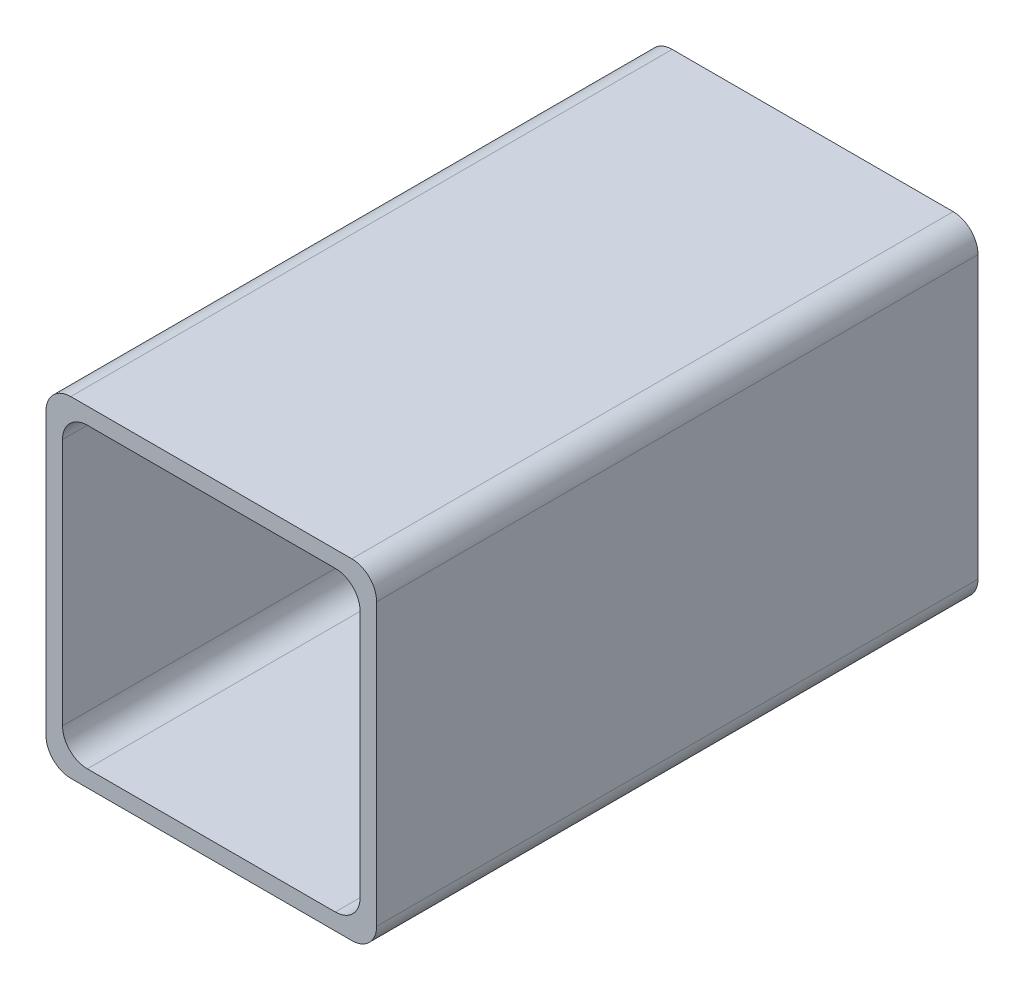
ISO-10303-21;
HEADER;
FILE_DESCRIPTION(('STEP AP214'),'2;1');
FILE_NAME('part.step','',(''),(''),'','','');
FILE_SCHEMA(('AUTOMOTIVE_DESIGN { 1 0 10303 214 1 1 1 1 }'));
ENDSEC;
DATA;
#1=APPLICATION_CONTEXT('core data for automotive mechanical design processes');
#2=APPLICATION_PROTOCOL_DEFINITION('international standard','automotive_design',2000,#1);
#3=PRODUCT_CONTEXT('',#1,'mechanical');
#4=PRODUCT('Part','Part','',(#3));
#5=PRODUCT_RELATED_PRODUCT_CATEGORY('part','',(#4));
#6=PRODUCT_DEFINITION_FORMATION('','',#4);
#7=PRODUCT_DEFINITION_CONTEXT('part definition',#1,'design');
#8=PRODUCT_DEFINITION('design','',#6,#7);
#9=PRODUCT_DEFINITION_SHAPE('','',#8);
#10=(LENGTH_UNIT() NAMED_UNIT(*) SI_UNIT(.MILLI.,.METRE.));
#11=(NAMED_UNIT(*) PLANE_ANGLE_UNIT() SI_UNIT($,.RADIAN.));
#12=(NAMED_UNIT(*) SI_UNIT($,.STERADIAN.) SOLID_ANGLE_UNIT());
#13=UNCERTAINTY_MEASURE_WITH_UNIT(LENGTH_MEASURE(1.E-05),#10,'distance_accuracy_value','');
#14=(GEOMETRIC_REPRESENTATION_CONTEXT(3) GLOBAL_UNCERTAINTY_ASSIGNED_CONTEXT((#13)) GLOBAL_UNIT_ASSIGNED_CONTEXT((#10,
#11,#12)) REPRESENTATION_CONTEXT('',''));
#15=CARTESIAN_POINT('',(0.,0.,0.));
#16=DIRECTION('',(0.,0.,1.));
#17=DIRECTION('',(1.,0.,0.));
#18=AXIS2_PLACEMENT_3D('',#15,#16,#17);
#19=CARTESIAN_POINT('',(-20.0000000000002,17.0000000000001,129.318542494924));
#20=DIRECTION('',(1.,0.,0.));
#21=DIRECTION('',(0.,0.,-1.));
#22=AXIS2_PLACEMENT_3D('',#19,#20,#21);
#23=PLANE('',#22);
#24=DIRECTION('',(0.,-1.,0.));
#25=VECTOR('',#24,1.);
#26=CARTESIAN_POINT('',(-19.9999999999999,17.,72.7499999999999));
#27=LINE('',#26,#25);
#28=CARTESIAN_POINT('',(-19.9999999999999,17.,72.7499999999999));
#29=VERTEX_POINT('',#28);
#30=CARTESIAN_POINT('',(-19.9999999999997,-17.,72.7499999999999));
#31=VERTEX_POINT('',#30);
#32=EDGE_CURVE('E303',#29,#31,#27,.T.);
#33=ORIENTED_EDGE('',*,*,#32,.F.);
#34=DIRECTION('',(0.,0.,-1.));
#35=VECTOR('',#34,1.);
#36=CARTESIAN_POINT('',(-20.0000000000002,17.0000000000001,129.318542494924));
#37=LINE('',#36,#35);
#38=CARTESIAN_POINT('',(-20.0000000000002,17.,0.));
#39=VERTEX_POINT('',#38);
#40=EDGE_CURVE('E47',#29,#39,#37,.T.);
#41=ORIENTED_EDGE('',*,*,#40,.T.);
#42=DIRECTION('',(0.,-1.,0.));
#43=VECTOR('',#42,1.);
#44=CARTESIAN_POINT('',(-20.0000000000002,17.,0.));
#45=LINE('',#44,#43);
#46=CARTESIAN_POINT('',(-20.,-17.,0.));
#47=VERTEX_POINT('',#46);
#48=EDGE_CURVE('E198',#39,#47,#45,.T.);
#49=ORIENTED_EDGE('',*,*,#48,.T.);
#50=DIRECTION('',(0.,0.,-1.));
#51=VECTOR('',#50,1.);
#52=CARTESIAN_POINT('',(-20.,-16.9999999999999,129.318542494924));
#53=LINE('',#52,#51);
#54=EDGE_CURVE('E201',#31,#47,#53,.T.);
#55=ORIENTED_EDGE('',*,*,#54,.F.);
#56=EDGE_LOOP('',(#33,#41,#49,#55));
#57=FACE_BOUND('',#56,.T.);
#58=ADVANCED_FACE('F32',(#57),#23,.F.);
#59=CARTESIAN_POINT('',(-17.0000000000002,17.0000000000001,129.318542494924));
#60=DIRECTION('',(0.,0.,-1.));
#61=DIRECTION('',(-1.,0.,0.));
#62=AXIS2_PLACEMENT_3D('',#59,#60,#61);
#63=CYLINDRICAL_SURFACE('',#62,3.);
#64=CARTESIAN_POINT('',(-16.9999999999999,17.,72.7499999999999));
#65=DIRECTION('',(0.,0.,1.));
#66=DIRECTION('',(1.,0.,0.));
#67=AXIS2_PLACEMENT_3D('',#64,#65,#66);
#68=CIRCLE('',#67,3.);
#69=CARTESIAN_POINT('',(-16.9999999999999,20.,72.7499999999999));
#70=VERTEX_POINT('',#69);
#71=EDGE_CURVE('E239',#70,#29,#68,.T.);
#72=ORIENTED_EDGE('',*,*,#71,.F.);
#73=DIRECTION('',(0.,0.,-1.));
#74=VECTOR('',#73,1.);
#75=CARTESIAN_POINT('',(-17.0000000000002,20.0000000000001,129.318542494924));
#76=LINE('',#75,#74);
#77=CARTESIAN_POINT('',(-17.0000000000002,20.,0.));
#78=VERTEX_POINT('',#77);
#79=EDGE_CURVE('E204',#70,#78,#76,.T.);
#80=ORIENTED_EDGE('',*,*,#79,.T.);
#81=CARTESIAN_POINT('',(-17.0000000000002,17.,0.));
#82=DIRECTION('',(0.,0.,1.));
#83=DIRECTION('',(1.,0.,0.));
#84=AXIS2_PLACEMENT_3D('',#81,#82,#83);
#85=CIRCLE('',#84,3.);
#86=EDGE_CURVE('E196',#78,#39,#85,.T.);
#87=ORIENTED_EDGE('',*,*,#86,.T.);
#88=ORIENTED_EDGE('',*,*,#40,.F.);
#89=EDGE_LOOP('',(#72,#80,#87,#88));
#90=FACE_BOUND('',#89,.T.);
#91=ADVANCED_FACE('F236',(#90),#63,.T.);
#92=CARTESIAN_POINT('',(16.9999999999998,20.0000000000001,129.318542494924));
#93=DIRECTION('',(0.,-1.,0.));
#94=DIRECTION('',(0.,0.,-1.));
#95=AXIS2_PLACEMENT_3D('',#92,#93,#94);
#96=PLANE('',#95);
#97=DIRECTION('',(-1.,0.,0.));
#98=VECTOR('',#97,1.);
#99=CARTESIAN_POINT('',(17.0000000000001,20.,72.7499999999999));
#100=LINE('',#99,#98);
#101=CARTESIAN_POINT('',(17.0000000000001,20.,72.7499999999999));
#102=VERTEX_POINT('',#101);
#103=EDGE_CURVE('E244',#102,#70,#100,.T.);
#104=ORIENTED_EDGE('',*,*,#103,.F.);
#105=DIRECTION('',(0.,0.,-1.));
#106=VECTOR('',#105,1.);
#107=CARTESIAN_POINT('',(16.9999999999998,20.0000000000001,129.318542494924));
#108=LINE('',#107,#106);
#109=CARTESIAN_POINT('',(16.9999999999998,20.,0.));
#110=VERTEX_POINT('',#109);
#111=EDGE_CURVE('E206',#102,#110,#108,.T.);
#112=ORIENTED_EDGE('',*,*,#111,.T.);
#113=DIRECTION('',(-1.,0.,0.));
#114=VECTOR('',#113,1.);
#115=CARTESIAN_POINT('',(16.9999999999998,20.,0.));
#116=LINE('',#115,#114);
#117=EDGE_CURVE('E193',#110,#78,#116,.T.);
#118=ORIENTED_EDGE('',*,*,#117,.T.);
#119=ORIENTED_EDGE('',*,*,#79,.F.);
#120=EDGE_LOOP('',(#104,#112,#118,#119));
#121=FACE_BOUND('',#120,.T.);
#122=ADVANCED_FACE('F242',(#121),#96,.F.);
#123=CARTESIAN_POINT('',(16.9999999999998,17.0000000000001,129.318542494924));
#124=DIRECTION('',(0.,0.,-1.));
#125=DIRECTION('',(-1.,0.,0.));
#126=AXIS2_PLACEMENT_3D('',#123,#124,#125);
#127=CYLINDRICAL_SURFACE('',#126,3.);
#128=CARTESIAN_POINT('',(17.0000000000001,17.,72.7499999999999));
#129=DIRECTION('',(0.,0.,1.));
#130=DIRECTION('',(1.,0.,0.));
#131=AXIS2_PLACEMENT_3D('',#128,#129,#130);
#132=CIRCLE('',#131,3.);
#133=CARTESIAN_POINT('',(20.0000000000001,17.,72.7499999999998));
#134=VERTEX_POINT('',#133);
#135=EDGE_CURVE('E307',#134,#102,#132,.T.);
#136=ORIENTED_EDGE('',*,*,#135,.F.);
#137=DIRECTION('',(0.,0.,-1.));
#138=VECTOR('',#137,1.);
#139=CARTESIAN_POINT('',(19.9999999999999,17.0000000000001,129.318542494924));
#140=LINE('',#139,#138);
#141=CARTESIAN_POINT('',(19.9999999999999,17.,0.));
#142=VERTEX_POINT('',#141);
#143=EDGE_CURVE('E208',#134,#142,#140,.T.);
#144=ORIENTED_EDGE('',*,*,#143,.T.);
#145=CARTESIAN_POINT('',(16.9999999999998,17.,0.));
#146=DIRECTION('',(0.,0.,1.));
#147=DIRECTION('',(-1.,0.,0.));
#148=AXIS2_PLACEMENT_3D('',#145,#146,#147);
#149=CIRCLE('',#148,3.);
#150=EDGE_CURVE('E190',#142,#110,#149,.T.);
#151=ORIENTED_EDGE('',*,*,#150,.T.);
#152=ORIENTED_EDGE('',*,*,#111,.F.);
#153=EDGE_LOOP('',(#136,#144,#151,#152));
#154=FACE_BOUND('',#153,.T.);
#155=ADVANCED_FACE('F247',(#154),#127,.T.);
#156=CARTESIAN_POINT('',(19.9999999999999,17.0000000000001,129.318542494924));
#157=DIRECTION('',(-1.,0.,0.));
#158=DIRECTION('',(0.,0.,1.));
#159=AXIS2_PLACEMENT_3D('',#156,#157,#158);
#160=PLANE('',#159);
#161=DIRECTION('',(0.,1.,0.));
#162=VECTOR('',#161,1.);
#163=CARTESIAN_POINT('',(20.0000000000001,17.,72.7499999999998));
#164=LINE('',#163,#162);
#165=CARTESIAN_POINT('',(20.0000000000003,-17.,72.7499999999999));
#166=VERTEX_POINT('',#165);
#167=EDGE_CURVE('E253',#166,#134,#164,.T.);
#168=ORIENTED_EDGE('',*,*,#167,.F.);
#169=DIRECTION('',(0.,0.,-1.));
#170=VECTOR('',#169,1.);
#171=CARTESIAN_POINT('',(20.,-17.,129.318542494924));
#172=LINE('',#171,#170);
#173=CARTESIAN_POINT('',(20.,-17.,0.));
#174=VERTEX_POINT('',#173);
#175=EDGE_CURVE('E210',#166,#174,#172,.T.);
#176=ORIENTED_EDGE('',*,*,#175,.T.);
#177=DIRECTION('',(0.,1.,0.));
#178=VECTOR('',#177,1.);
#179=CARTESIAN_POINT('',(19.9999999999999,17.,0.));
#180=LINE('',#179,#178);
#181=EDGE_CURVE('E187',#174,#142,#180,.T.);
#182=ORIENTED_EDGE('',*,*,#181,.T.);
#183=ORIENTED_EDGE('',*,*,#143,.F.);
#184=EDGE_LOOP('',(#168,#176,#182,#183));
#185=FACE_BOUND('',#184,.T.);
#186=ADVANCED_FACE('F250',(#185),#160,.F.);
#187=CARTESIAN_POINT('',(17.,-17.,129.318542494924));
#188=DIRECTION('',(0.,0.,-1.));
#189=DIRECTION('',(-1.,0.,0.));
#190=AXIS2_PLACEMENT_3D('',#187,#188,#189);
#191=CYLINDRICAL_SURFACE('',#190,3.);
#192=CARTESIAN_POINT('',(17.0000000000003,-17.,72.75));
#193=DIRECTION('',(0.,0.,1.));
#194=DIRECTION('',(1.,0.,0.));
#195=AXIS2_PLACEMENT_3D('',#192,#193,#194);
#196=CIRCLE('',#195,3.);
#197=CARTESIAN_POINT('',(17.0000000000003,-20.,72.75));
#198=VERTEX_POINT('',#197);
#199=EDGE_CURVE('E257',#198,#166,#196,.T.);
#200=ORIENTED_EDGE('',*,*,#199,.F.);
#201=DIRECTION('',(0.,0.,-1.));
#202=VECTOR('',#201,1.);
#203=CARTESIAN_POINT('',(17.,-20.,129.318542494924));
#204=LINE('',#203,#202);
#205=CARTESIAN_POINT('',(17.,-20.,0.));
#206=VERTEX_POINT('',#205);
#207=EDGE_CURVE('E212',#198,#206,#204,.T.);
#208=ORIENTED_EDGE('',*,*,#207,.T.);
#209=CARTESIAN_POINT('',(17.,-17.,0.));
#210=DIRECTION('',(0.,0.,1.));
#211=DIRECTION('',(1.,0.,0.));
#212=AXIS2_PLACEMENT_3D('',#209,#210,#211);
#213=CIRCLE('',#212,3.);
#214=EDGE_CURVE('E184',#206,#174,#213,.T.);
#215=ORIENTED_EDGE('',*,*,#214,.T.);
#216=ORIENTED_EDGE('',*,*,#175,.F.);
#217=EDGE_LOOP('',(#200,#208,#215,#216));
#218=FACE_BOUND('',#217,.T.);
#219=ADVANCED_FACE('F256',(#218),#191,.T.);
#220=CARTESIAN_POINT('',(17.,-20.,129.318542494924));
#221=DIRECTION('',(0.,1.,0.));
#222=DIRECTION('',(0.,0.,1.));
#223=AXIS2_PLACEMENT_3D('',#220,#221,#222);
#224=PLANE('',#223);
#225=DIRECTION('',(1.,0.,0.));
#226=VECTOR('',#225,1.);
#227=CARTESIAN_POINT('',(17.0000000000003,-20.,72.75));
#228=LINE('',#227,#226);
#229=CARTESIAN_POINT('',(-16.9999999999997,-20.,72.7499999999999));
#230=VERTEX_POINT('',#229);
#231=EDGE_CURVE('E220',#230,#198,#228,.T.);
#232=ORIENTED_EDGE('',*,*,#231,.F.);
#233=DIRECTION('',(0.,0.,-1.));
#234=VECTOR('',#233,1.);
#235=CARTESIAN_POINT('',(-17.,-19.9999999999999,129.318542494924));
#236=LINE('',#235,#234);
#237=CARTESIAN_POINT('',(-17.,-20.,0.));
#238=VERTEX_POINT('',#237);
#239=EDGE_CURVE('E40',#230,#238,#236,.T.);
#240=ORIENTED_EDGE('',*,*,#239,.T.);
#241=DIRECTION('',(1.,0.,0.));
#242=VECTOR('',#241,1.);
#243=CARTESIAN_POINT('',(17.,-20.,0.));
#244=LINE('',#243,#242);
#245=EDGE_CURVE('E181',#238,#206,#244,.T.);
#246=ORIENTED_EDGE('',*,*,#245,.T.);
#247=ORIENTED_EDGE('',*,*,#207,.F.);
#248=EDGE_LOOP('',(#232,#240,#246,#247));
#249=FACE_BOUND('',#248,.T.);
#250=ADVANCED_FACE('F216',(#249),#224,.F.);
#251=CARTESIAN_POINT('',(-17.,-16.9999999999999,129.318542494924));
#252=DIRECTION('',(0.,0.,-1.));
#253=DIRECTION('',(-1.,0.,0.));
#254=AXIS2_PLACEMENT_3D('',#251,#252,#253);
#255=CYLINDRICAL_SURFACE('',#254,3.);
#256=CARTESIAN_POINT('',(-16.9999999999997,-17.,72.7499999999999));
#257=DIRECTION('',(0.,0.,1.));
#258=DIRECTION('',(1.,0.,0.));
#259=AXIS2_PLACEMENT_3D('',#256,#257,#258);
#260=CIRCLE('',#259,3.);
#261=EDGE_CURVE('E230',#31,#230,#260,.T.);
#262=ORIENTED_EDGE('',*,*,#261,.F.);
#263=ORIENTED_EDGE('',*,*,#54,.T.);
#264=CARTESIAN_POINT('',(-17.,-17.,0.));
#265=DIRECTION('',(0.,0.,1.));
#266=DIRECTION('',(-1.,0.,0.));
#267=AXIS2_PLACEMENT_3D('',#264,#265,#266);
#268=CIRCLE('',#267,3.);
#269=EDGE_CURVE('E178',#47,#238,#268,.T.);
#270=ORIENTED_EDGE('',*,*,#269,.T.);
#271=ORIENTED_EDGE('',*,*,#239,.F.);
#272=EDGE_LOOP('',(#262,#263,#270,#271));
#273=FACE_BOUND('',#272,.T.);
#274=ADVANCED_FACE('F34',(#273),#255,.T.);
#275=CARTESIAN_POINT('',(-17.,-17.,0.));
#276=DIRECTION('',(0.,0.,-1.));
#277=DIRECTION('',(-1.,0.,0.));
#278=AXIS2_PLACEMENT_3D('',#275,#276,#277);
#279=PLANE('',#278);
#280=ORIENTED_EDGE('',*,*,#269,.F.);
#281=ORIENTED_EDGE('',*,*,#48,.F.);
#282=ORIENTED_EDGE('',*,*,#86,.F.);
#283=ORIENTED_EDGE('',*,*,#117,.F.);
#284=ORIENTED_EDGE('',*,*,#150,.F.);
#285=ORIENTED_EDGE('',*,*,#181,.F.);
#286=ORIENTED_EDGE('',*,*,#214,.F.);
#287=ORIENTED_EDGE('',*,*,#245,.F.);
#288=EDGE_LOOP('',(#280,#281,#282,#283,#284,#285,#286,#287));
#289=FACE_BOUND('',#288,.T.);
#290=DIRECTION('',(-1.,0.,0.));
#291=VECTOR('',#290,1.);
#292=CARTESIAN_POINT('',(-15.0000000000002,18.,0.));
#293=LINE('',#292,#291);
#294=CARTESIAN_POINT('',(14.9999999999998,18.,0.));
#295=VERTEX_POINT('',#294);
#296=CARTESIAN_POINT('',(-15.0000000000002,18.,0.));
#297=VERTEX_POINT('',#296);
#298=EDGE_CURVE('E160',#295,#297,#293,.T.);
#299=ORIENTED_EDGE('',*,*,#298,.T.);
#300=CARTESIAN_POINT('',(-15.,15.,0.));
#301=DIRECTION('',(0.,0.,1.));
#302=DIRECTION('',(-1.,0.,0.));
#303=AXIS2_PLACEMENT_3D('',#300,#301,#302);
#304=CIRCLE('',#303,3.);
#305=CARTESIAN_POINT('',(-18.,15.,0.));
#306=VERTEX_POINT('',#305);
#307=EDGE_CURVE('E259',#297,#306,#304,.T.);
#308=ORIENTED_EDGE('',*,*,#307,.T.);
#309=DIRECTION('',(0.,-1.,0.));
#310=VECTOR('',#309,1.);
#311=CARTESIAN_POINT('',(-18.,-15.,0.));
#312=LINE('',#311,#310);
#313=CARTESIAN_POINT('',(-18.,-15.,0.));
#314=VERTEX_POINT('',#313);
#315=EDGE_CURVE('E266',#306,#314,#312,.T.);
#316=ORIENTED_EDGE('',*,*,#315,.T.);
#317=CARTESIAN_POINT('',(-15.,-15.,0.));
#318=DIRECTION('',(0.,0.,1.));
#319=DIRECTION('',(1.,0.,0.));
#320=AXIS2_PLACEMENT_3D('',#317,#318,#319);
#321=CIRCLE('',#320,3.);
#322=CARTESIAN_POINT('',(-15.,-18.,0.));
#323=VERTEX_POINT('',#322);
#324=EDGE_CURVE('E269',#314,#323,#321,.T.);
#325=ORIENTED_EDGE('',*,*,#324,.T.);
#326=DIRECTION('',(1.,0.,0.));
#327=VECTOR('',#326,1.);
#328=CARTESIAN_POINT('',(-15.,-18.,0.));
#329=LINE('',#328,#327);
#330=CARTESIAN_POINT('',(15.,-18.,0.));
#331=VERTEX_POINT('',#330);
#332=EDGE_CURVE('E272',#323,#331,#329,.T.);
#333=ORIENTED_EDGE('',*,*,#332,.T.);
#334=CARTESIAN_POINT('',(15.,-15.,0.));
#335=DIRECTION('',(0.,0.,1.));
#336=DIRECTION('',(-1.,0.,0.));
#337=AXIS2_PLACEMENT_3D('',#334,#335,#336);
#338=CIRCLE('',#337,3.);
#339=CARTESIAN_POINT('',(18.,-15.,0.));
#340=VERTEX_POINT('',#339);
#341=EDGE_CURVE('E275',#331,#340,#338,.T.);
#342=ORIENTED_EDGE('',*,*,#341,.T.);
#343=DIRECTION('',(0.,1.,0.));
#344=VECTOR('',#343,1.);
#345=CARTESIAN_POINT('',(18.,-15.,0.));
#346=LINE('',#345,#344);
#347=CARTESIAN_POINT('',(18.,15.,0.));
#348=VERTEX_POINT('',#347);
#349=EDGE_CURVE('E278',#340,#348,#346,.T.);
#350=ORIENTED_EDGE('',*,*,#349,.T.);
#351=CARTESIAN_POINT('',(15.,15.,0.));
#352=DIRECTION('',(0.,0.,1.));
#353=DIRECTION('',(1.,0.,0.));
#354=AXIS2_PLACEMENT_3D('',#351,#352,#353);
#355=CIRCLE('',#354,3.);
#356=EDGE_CURVE('E281',#348,#295,#355,.T.);
#357=ORIENTED_EDGE('',*,*,#356,.T.);
#358=EDGE_LOOP('',(#299,#308,#316,#325,#333,#342,#350,#357));
#359=FACE_BOUND('',#358,.T.);
#360=ADVANCED_FACE('F226',(#289,#359),#279,.T.);
#361=CARTESIAN_POINT('',(-15.0000000000002,18.0000000000001,129.318542494924));
#362=DIRECTION('',(0.,-1.,0.));
#363=DIRECTION('',(0.,0.,-1.));
#364=AXIS2_PLACEMENT_3D('',#361,#362,#363);
#365=PLANE('',#364);
#366=DIRECTION('',(0.,0.,-1.));
#367=VECTOR('',#366,1.);
#368=CARTESIAN_POINT('',(14.9999999999998,18.0000000000001,129.318542494924));
#369=LINE('',#368,#367);
#370=CARTESIAN_POINT('',(15.0000000000001,18.,72.7499999999999));
#371=VERTEX_POINT('',#370);
#372=EDGE_CURVE('E152',#371,#295,#369,.T.);
#373=ORIENTED_EDGE('',*,*,#372,.F.);
#374=DIRECTION('',(-1.,0.,0.));
#375=VECTOR('',#374,1.);
#376=CARTESIAN_POINT('',(-14.9999999999999,18.,72.7499999999999));
#377=LINE('',#376,#375);
#378=CARTESIAN_POINT('',(-14.9999999999999,18.,72.7499999999999));
#379=VERTEX_POINT('',#378);
#380=EDGE_CURVE('E11',#371,#379,#377,.T.);
#381=ORIENTED_EDGE('',*,*,#380,.T.);
#382=DIRECTION('',(0.,0.,-1.));
#383=VECTOR('',#382,1.);
#384=CARTESIAN_POINT('',(-15.0000000000002,18.0000000000001,129.318542494924));
#385=LINE('',#384,#383);
#386=EDGE_CURVE('E162',#379,#297,#385,.T.);
#387=ORIENTED_EDGE('',*,*,#386,.T.);
#388=ORIENTED_EDGE('',*,*,#298,.F.);
#389=EDGE_LOOP('',(#373,#381,#387,#388));
#390=FACE_BOUND('',#389,.T.);
#391=ADVANCED_FACE('F158',(#390),#365,.T.);
#392=CARTESIAN_POINT('',(15.,15.0000000000001,129.318542494924));
#393=DIRECTION('',(0.,0.,-1.));
#394=DIRECTION('',(-1.,0.,0.));
#395=AXIS2_PLACEMENT_3D('',#392,#393,#394);
#396=CYLINDRICAL_SURFACE('',#395,3.);
#397=DIRECTION('',(0.,0.,-1.));
#398=VECTOR('',#397,1.);
#399=CARTESIAN_POINT('',(18.,15.0000000000001,129.318542494924));
#400=LINE('',#399,#398);
#401=CARTESIAN_POINT('',(18.0000000000003,15.0000000000001,72.7499999999999));
#402=VERTEX_POINT('',#401);
#403=EDGE_CURVE('E154',#402,#348,#400,.T.);
#404=ORIENTED_EDGE('',*,*,#403,.F.);
#405=CARTESIAN_POINT('',(15.0000000000003,15.0000000000001,72.7499999999999));
#406=DIRECTION('',(0.,0.,1.));
#407=DIRECTION('',(1.,0.,0.));
#408=AXIS2_PLACEMENT_3D('',#405,#406,#407);
#409=CIRCLE('',#408,3.);
#410=EDGE_CURVE('E145',#402,#371,#409,.T.);
#411=ORIENTED_EDGE('',*,*,#410,.T.);
#412=ORIENTED_EDGE('',*,*,#372,.T.);
#413=ORIENTED_EDGE('',*,*,#356,.F.);
#414=EDGE_LOOP('',(#404,#411,#412,#413));
#415=FACE_BOUND('',#414,.T.);
#416=ADVANCED_FACE('F150',(#415),#396,.F.);
#417=CARTESIAN_POINT('',(18.,-15.,129.318542494924));
#418=DIRECTION('',(-1.,0.,0.));
#419=DIRECTION('',(0.,0.,1.));
#420=AXIS2_PLACEMENT_3D('',#417,#418,#419);
#421=PLANE('',#420);
#422=DIRECTION('',(0.,0.,-1.));
#423=VECTOR('',#422,1.);
#424=CARTESIAN_POINT('',(18.,-15.,129.318542494924));
#425=LINE('',#424,#423);
#426=CARTESIAN_POINT('',(18.0000000000003,-15.,72.75));
#427=VERTEX_POINT('',#426);
#428=EDGE_CURVE('E164',#427,#340,#425,.T.);
#429=ORIENTED_EDGE('',*,*,#428,.F.);
#430=DIRECTION('',(0.,1.,0.));
#431=VECTOR('',#430,1.);
#432=CARTESIAN_POINT('',(18.0000000000003,-15.,72.75));
#433=LINE('',#432,#431);
#434=EDGE_CURVE('E156',#427,#402,#433,.T.);
#435=ORIENTED_EDGE('',*,*,#434,.T.);
#436=ORIENTED_EDGE('',*,*,#403,.T.);
#437=ORIENTED_EDGE('',*,*,#349,.F.);
#438=EDGE_LOOP('',(#429,#435,#436,#437));
#439=FACE_BOUND('',#438,.T.);
#440=ADVANCED_FACE('F287',(#439),#421,.T.);
#441=CARTESIAN_POINT('',(15.,-15.,129.318542494924));
#442=DIRECTION('',(0.,0.,-1.));
#443=DIRECTION('',(-1.,0.,0.));
#444=AXIS2_PLACEMENT_3D('',#441,#442,#443);
#445=CYLINDRICAL_SURFACE('',#444,3.);
#446=DIRECTION('',(0.,0.,-1.));
#447=VECTOR('',#446,1.);
#448=CARTESIAN_POINT('',(15.,-18.,129.318542494924));
#449=LINE('',#448,#447);
#450=CARTESIAN_POINT('',(15.0000000000003,-18.,72.7499999999999));
#451=VERTEX_POINT('',#450);
#452=EDGE_CURVE('E170',#451,#331,#449,.T.);
#453=ORIENTED_EDGE('',*,*,#452,.F.);
#454=CARTESIAN_POINT('',(15.0000000000003,-15.,72.7499999999999));
#455=DIRECTION('',(0.,0.,1.));
#456=DIRECTION('',(1.,0.,0.));
#457=AXIS2_PLACEMENT_3D('',#454,#455,#456);
#458=CIRCLE('',#457,3.);
#459=EDGE_CURVE('E289',#451,#427,#458,.T.);
#460=ORIENTED_EDGE('',*,*,#459,.T.);
#461=ORIENTED_EDGE('',*,*,#428,.T.);
#462=ORIENTED_EDGE('',*,*,#341,.F.);
#463=EDGE_LOOP('',(#453,#460,#461,#462));
#464=FACE_BOUND('',#463,.T.);
#465=ADVANCED_FACE('F324',(#464),#445,.F.);
#466=CARTESIAN_POINT('',(-15.,-18.,129.318542494924));
#467=DIRECTION('',(0.,1.,0.));
#468=DIRECTION('',(0.,0.,1.));
#469=AXIS2_PLACEMENT_3D('',#466,#467,#468);
#470=PLANE('',#469);
#471=DIRECTION('',(0.,0.,-1.));
#472=VECTOR('',#471,1.);
#473=CARTESIAN_POINT('',(-15.,-18.,129.318542494924));
#474=LINE('',#473,#472);
#475=CARTESIAN_POINT('',(-14.9999999999997,-18.,72.75));
#476=VERTEX_POINT('',#475);
#477=EDGE_CURVE('E172',#476,#323,#474,.T.);
#478=ORIENTED_EDGE('',*,*,#477,.F.);
#479=DIRECTION('',(1.,0.,0.));
#480=VECTOR('',#479,1.);
#481=CARTESIAN_POINT('',(-14.9999999999997,-18.,72.75));
#482=LINE('',#481,#480);
#483=EDGE_CURVE('E291',#476,#451,#482,.T.);
#484=ORIENTED_EDGE('',*,*,#483,.T.);
#485=ORIENTED_EDGE('',*,*,#452,.T.);
#486=ORIENTED_EDGE('',*,*,#332,.F.);
#487=EDGE_LOOP('',(#478,#484,#485,#486));
#488=FACE_BOUND('',#487,.T.);
#489=ADVANCED_FACE('F321',(#488),#470,.T.);
#490=CARTESIAN_POINT('',(-15.,-14.9999999999999,129.318542494924));
#491=DIRECTION('',(0.,0.,-1.));
#492=DIRECTION('',(-1.,0.,0.));
#493=AXIS2_PLACEMENT_3D('',#490,#491,#492);
#494=CYLINDRICAL_SURFACE('',#493,3.);
#495=DIRECTION('',(0.,0.,-1.));
#496=VECTOR('',#495,1.);
#497=CARTESIAN_POINT('',(-18.,-14.9999999999999,129.318542494924));
#498=LINE('',#497,#496);
#499=CARTESIAN_POINT('',(-17.9999999999997,-15.,72.7499999999999));
#500=VERTEX_POINT('',#499);
#501=EDGE_CURVE('E174',#500,#314,#498,.T.);
#502=ORIENTED_EDGE('',*,*,#501,.F.);
#503=CARTESIAN_POINT('',(-14.9999999999997,-15.,72.7499999999999));
#504=DIRECTION('',(0.,0.,1.));
#505=DIRECTION('',(1.,0.,0.));
#506=AXIS2_PLACEMENT_3D('',#503,#504,#505);
#507=CIRCLE('',#506,3.);
#508=EDGE_CURVE('E296',#500,#476,#507,.T.);
#509=ORIENTED_EDGE('',*,*,#508,.T.);
#510=ORIENTED_EDGE('',*,*,#477,.T.);
#511=ORIENTED_EDGE('',*,*,#324,.F.);
#512=EDGE_LOOP('',(#502,#509,#510,#511));
#513=FACE_BOUND('',#512,.T.);
#514=ADVANCED_FACE('F318',(#513),#494,.F.);
#515=CARTESIAN_POINT('',(-18.,-14.9999999999999,129.318542494924));
#516=DIRECTION('',(1.,0.,0.));
#517=DIRECTION('',(0.,0.,-1.));
#518=AXIS2_PLACEMENT_3D('',#515,#516,#517);
#519=PLANE('',#518);
#520=DIRECTION('',(0.,0.,-1.));
#521=VECTOR('',#520,1.);
#522=CARTESIAN_POINT('',(-18.,15.0000000000001,129.318542494924));
#523=LINE('',#522,#521);
#524=CARTESIAN_POINT('',(-17.9999999999997,15.0000000000001,72.7499999999999));
#525=VERTEX_POINT('',#524);
#526=EDGE_CURVE('E176',#525,#306,#523,.T.);
#527=ORIENTED_EDGE('',*,*,#526,.F.);
#528=DIRECTION('',(0.,-1.,0.));
#529=VECTOR('',#528,1.);
#530=CARTESIAN_POINT('',(-17.9999999999997,-15.,72.7499999999999));
#531=LINE('',#530,#529);
#532=EDGE_CURVE('E299',#525,#500,#531,.T.);
#533=ORIENTED_EDGE('',*,*,#532,.T.);
#534=ORIENTED_EDGE('',*,*,#501,.T.);
#535=ORIENTED_EDGE('',*,*,#315,.F.);
#536=EDGE_LOOP('',(#527,#533,#534,#535));
#537=FACE_BOUND('',#536,.T.);
#538=ADVANCED_FACE('F313',(#537),#519,.T.);
#539=CARTESIAN_POINT('',(-15.,15.0000000000001,129.318542494924));
#540=DIRECTION('',(0.,0.,-1.));
#541=DIRECTION('',(-1.,0.,0.));
#542=AXIS2_PLACEMENT_3D('',#539,#540,#541);
#543=CYLINDRICAL_SURFACE('',#542,3.);
#544=ORIENTED_EDGE('',*,*,#386,.F.);
#545=CARTESIAN_POINT('',(-14.9999999999997,15.0000000000001,72.7499999999999));
#546=DIRECTION('',(0.,0.,1.));
#547=DIRECTION('',(1.,0.,0.));
#548=AXIS2_PLACEMENT_3D('',#545,#546,#547);
#549=CIRCLE('',#548,3.);
#550=EDGE_CURVE('E55',#379,#525,#549,.T.);
#551=ORIENTED_EDGE('',*,*,#550,.T.);
#552=ORIENTED_EDGE('',*,*,#526,.T.);
#553=ORIENTED_EDGE('',*,*,#307,.F.);
#554=EDGE_LOOP('',(#544,#551,#552,#553));
#555=FACE_BOUND('',#554,.T.);
#556=ADVANCED_FACE('F309',(#555),#543,.F.);
#557=CARTESIAN_POINT('',(2.77555756156289E-13,0.,72.7499999999999));
#558=DIRECTION('',(0.,0.,1.));
#559=DIRECTION('',(0.99936665420733,0.0355849751784164,0.));
#560=AXIS2_PLACEMENT_3D('',#557,#558,#559);
#561=PLANE('',#560);
#562=ORIENTED_EDGE('',*,*,#550,.F.);
#563=ORIENTED_EDGE('',*,*,#380,.F.);
#564=ORIENTED_EDGE('',*,*,#410,.F.);
#565=ORIENTED_EDGE('',*,*,#434,.F.);
#566=ORIENTED_EDGE('',*,*,#459,.F.);
#567=ORIENTED_EDGE('',*,*,#483,.F.);
#568=ORIENTED_EDGE('',*,*,#508,.F.);
#569=ORIENTED_EDGE('',*,*,#532,.F.);
#570=EDGE_LOOP('',(#562,#563,#564,#565,#566,#567,#568,#569));
#571=FACE_BOUND('',#570,.T.);
#572=ORIENTED_EDGE('',*,*,#32,.T.);
#573=ORIENTED_EDGE('',*,*,#261,.T.);
#574=ORIENTED_EDGE('',*,*,#231,.T.);
#575=ORIENTED_EDGE('',*,*,#199,.T.);
#576=ORIENTED_EDGE('',*,*,#167,.T.);
#577=ORIENTED_EDGE('',*,*,#135,.T.);
#578=ORIENTED_EDGE('',*,*,#103,.T.);
#579=ORIENTED_EDGE('',*,*,#71,.T.);
#580=EDGE_LOOP('',(#572,#573,#574,#575,#576,#577,#578,#579));
#581=FACE_BOUND('',#580,.T.);
#582=ADVANCED_FACE('F143',(#571,#581),#561,.T.);
#583=CLOSED_SHELL('',(#58,#91,#122,#155,#186,#219,#250,#274,#360,#391,#416,#440,#465,#489,#514,
#538,#556,#582));
#584=MANIFOLD_SOLID_BREP('B2',#583);
#585=ADVANCED_BREP_SHAPE_REPRESENTATION('',(#18,#584),#14);
#586=SHAPE_DEFINITION_REPRESENTATION(#9,#585);
ENDSEC;
END-ISO-10303-21;
